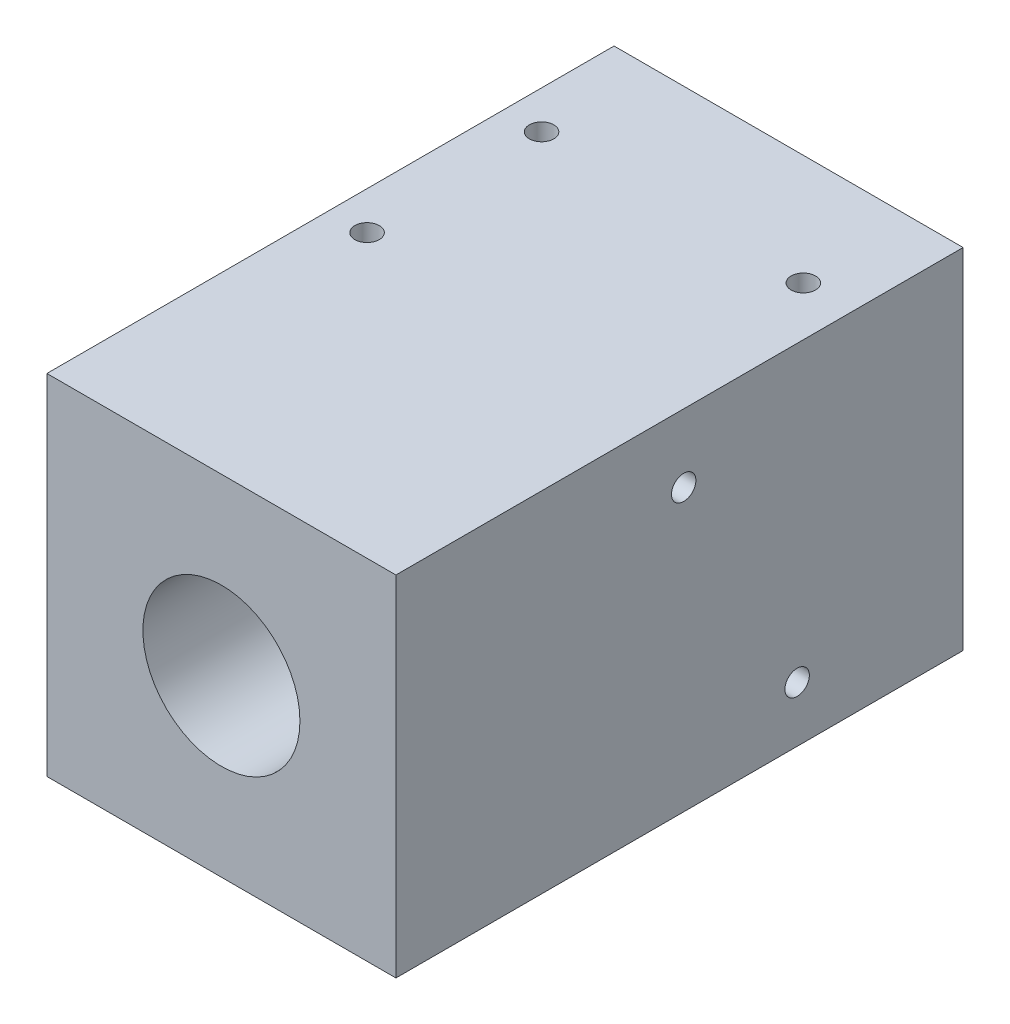
ISO-10303-21;
HEADER;
FILE_DESCRIPTION(('STEP AP214'),'2;1');
FILE_NAME('part.step','',(''),(''),'','','');
FILE_SCHEMA(('AUTOMOTIVE_DESIGN { 1 0 10303 214 1 1 1 1 }'));
ENDSEC;
DATA;
#1=APPLICATION_CONTEXT('core data for automotive mechanical design processes');
#2=APPLICATION_PROTOCOL_DEFINITION('international standard','automotive_design',2000,#1);
#3=PRODUCT_CONTEXT('',#1,'mechanical');
#4=PRODUCT('Part','Part','',(#3));
#5=PRODUCT_RELATED_PRODUCT_CATEGORY('part','',(#4));
#6=PRODUCT_DEFINITION_FORMATION('','',#4);
#7=PRODUCT_DEFINITION_CONTEXT('part definition',#1,'design');
#8=PRODUCT_DEFINITION('design','',#6,#7);
#9=PRODUCT_DEFINITION_SHAPE('','',#8);
#10=(LENGTH_UNIT() NAMED_UNIT(*) SI_UNIT(.MILLI.,.METRE.));
#11=(NAMED_UNIT(*) PLANE_ANGLE_UNIT() SI_UNIT($,.RADIAN.));
#12=(NAMED_UNIT(*) SI_UNIT($,.STERADIAN.) SOLID_ANGLE_UNIT());
#13=UNCERTAINTY_MEASURE_WITH_UNIT(LENGTH_MEASURE(1.E-05),#10,'distance_accuracy_value','');
#14=(GEOMETRIC_REPRESENTATION_CONTEXT(3) GLOBAL_UNCERTAINTY_ASSIGNED_CONTEXT((#13)) GLOBAL_UNIT_ASSIGNED_CONTEXT((#10,
#11,#12)) REPRESENTATION_CONTEXT('',''));
#15=CARTESIAN_POINT('',(0.,0.,0.));
#16=DIRECTION('',(0.,0.,1.));
#17=DIRECTION('',(1.,0.,0.));
#18=AXIS2_PLACEMENT_3D('',#15,#16,#17);
#19=CARTESIAN_POINT('',(0.,0.,65.));
#20=DIRECTION('',(0.,0.,-1.));
#21=DIRECTION('',(-1.,0.,0.));
#22=AXIS2_PLACEMENT_3D('',#19,#20,#21);
#23=PLANE('',#22);
#24=DIRECTION('',(0.,1.,0.));
#25=VECTOR('',#24,1.);
#26=CARTESIAN_POINT('',(20.,-20.,65.));
#27=LINE('',#26,#25);
#28=CARTESIAN_POINT('',(20.,-20.,65.));
#29=VERTEX_POINT('',#28);
#30=CARTESIAN_POINT('',(20.,20.,65.));
#31=VERTEX_POINT('',#30);
#32=EDGE_CURVE('E87',#29,#31,#27,.T.);
#33=ORIENTED_EDGE('',*,*,#32,.T.);
#34=DIRECTION('',(-1.,0.,0.));
#35=VECTOR('',#34,1.);
#36=CARTESIAN_POINT('',(-20.,20.,65.));
#37=LINE('',#36,#35);
#38=CARTESIAN_POINT('',(-20.,20.,65.));
#39=VERTEX_POINT('',#38);
#40=EDGE_CURVE('E82',#31,#39,#37,.T.);
#41=ORIENTED_EDGE('',*,*,#40,.T.);
#42=DIRECTION('',(0.,-1.,0.));
#43=VECTOR('',#42,1.);
#44=CARTESIAN_POINT('',(-20.,-20.,65.));
#45=LINE('',#44,#43);
#46=CARTESIAN_POINT('',(-20.,-20.,65.));
#47=VERTEX_POINT('',#46);
#48=EDGE_CURVE('E85',#39,#47,#45,.T.);
#49=ORIENTED_EDGE('',*,*,#48,.T.);
#50=DIRECTION('',(1.,0.,0.));
#51=VECTOR('',#50,1.);
#52=CARTESIAN_POINT('',(-20.,-20.,65.));
#53=LINE('',#52,#51);
#54=EDGE_CURVE('E52',#47,#29,#53,.T.);
#55=ORIENTED_EDGE('',*,*,#54,.T.);
#56=EDGE_LOOP('',(#33,#41,#49,#55));
#57=FACE_BOUND('',#56,.T.);
#58=CARTESIAN_POINT('',(0.,0.,65.));
#59=DIRECTION('',(0.,0.,1.));
#60=DIRECTION('',(1.,0.,0.));
#61=AXIS2_PLACEMENT_3D('',#58,#59,#60);
#62=CIRCLE('',#61,9.);
#63=CARTESIAN_POINT('',(9.,0.,65.));
#64=VERTEX_POINT('',#63);
#65=EDGE_CURVE('E103',#64,#64,#62,.T.);
#66=ORIENTED_EDGE('',*,*,#65,.F.);
#67=EDGE_LOOP('',(#66));
#68=FACE_BOUND('',#67,.T.);
#69=ADVANCED_FACE('F33',(#57,#68),#23,.F.);
#70=CARTESIAN_POINT('',(0.,0.,0.));
#71=DIRECTION('',(0.,0.,-1.));
#72=DIRECTION('',(-1.,0.,0.));
#73=AXIS2_PLACEMENT_3D('',#70,#71,#72);
#74=PLANE('',#73);
#75=DIRECTION('',(0.,1.,0.));
#76=VECTOR('',#75,1.);
#77=CARTESIAN_POINT('',(20.,-20.,0.));
#78=LINE('',#77,#76);
#79=CARTESIAN_POINT('',(20.,-20.,0.));
#80=VERTEX_POINT('',#79);
#81=CARTESIAN_POINT('',(20.,20.,0.));
#82=VERTEX_POINT('',#81);
#83=EDGE_CURVE('E100',#80,#82,#78,.T.);
#84=ORIENTED_EDGE('',*,*,#83,.F.);
#85=DIRECTION('',(1.,0.,0.));
#86=VECTOR('',#85,1.);
#87=CARTESIAN_POINT('',(-20.,-20.,0.));
#88=LINE('',#87,#86);
#89=CARTESIAN_POINT('',(-20.,-20.,0.));
#90=VERTEX_POINT('',#89);
#91=EDGE_CURVE('E75',#90,#80,#88,.T.);
#92=ORIENTED_EDGE('',*,*,#91,.F.);
#93=DIRECTION('',(0.,-1.,0.));
#94=VECTOR('',#93,1.);
#95=CARTESIAN_POINT('',(-20.,-20.,0.));
#96=LINE('',#95,#94);
#97=CARTESIAN_POINT('',(-20.,20.,0.));
#98=VERTEX_POINT('',#97);
#99=EDGE_CURVE('E69',#98,#90,#96,.T.);
#100=ORIENTED_EDGE('',*,*,#99,.F.);
#101=DIRECTION('',(-1.,0.,0.));
#102=VECTOR('',#101,1.);
#103=CARTESIAN_POINT('',(-20.,20.,0.));
#104=LINE('',#103,#102);
#105=EDGE_CURVE('E91',#82,#98,#104,.T.);
#106=ORIENTED_EDGE('',*,*,#105,.F.);
#107=EDGE_LOOP('',(#84,#92,#100,#106));
#108=FACE_BOUND('',#107,.T.);
#109=CARTESIAN_POINT('',(0.,0.,0.));
#110=DIRECTION('',(0.,0.,1.));
#111=DIRECTION('',(1.,0.,0.));
#112=AXIS2_PLACEMENT_3D('',#109,#110,#111);
#113=CIRCLE('',#112,9.);
#114=CARTESIAN_POINT('',(9.,0.,0.));
#115=VERTEX_POINT('',#114);
#116=EDGE_CURVE('E172',#115,#115,#113,.T.);
#117=ORIENTED_EDGE('',*,*,#116,.T.);
#118=EDGE_LOOP('',(#117));
#119=FACE_BOUND('',#118,.T.);
#120=ADVANCED_FACE('F134',(#108,#119),#74,.T.);
#121=CARTESIAN_POINT('',(20.,-20.,65.));
#122=DIRECTION('',(-1.,0.,0.));
#123=DIRECTION('',(0.,0.,1.));
#124=AXIS2_PLACEMENT_3D('',#121,#122,#123);
#125=PLANE('',#124);
#126=CARTESIAN_POINT('',(20.,12.2053062360702,32.0211991640393));
#127=DIRECTION('',(1.,0.,0.));
#128=DIRECTION('',(0.,0.,-1.));
#129=AXIS2_PLACEMENT_3D('',#126,#127,#128);
#130=CIRCLE('',#129,1.4);
#131=CARTESIAN_POINT('',(20.,12.2053062360702,30.6211991640393));
#132=VERTEX_POINT('',#131);
#133=EDGE_CURVE('E116',#132,#132,#130,.T.);
#134=ORIENTED_EDGE('',*,*,#133,.F.);
#135=EDGE_LOOP('',(#134));
#136=FACE_BOUND('',#135,.T.);
#137=CARTESIAN_POINT('',(20.,-13.6412808856617,19.0212010713877));
#138=DIRECTION('',(1.,0.,0.));
#139=DIRECTION('',(0.,0.,-1.));
#140=AXIS2_PLACEMENT_3D('',#137,#138,#139);
#141=CIRCLE('',#140,1.39999999999998);
#142=CARTESIAN_POINT('',(20.,-13.6412808856617,17.6212010713877));
#143=VERTEX_POINT('',#142);
#144=EDGE_CURVE('E211',#143,#143,#141,.T.);
#145=ORIENTED_EDGE('',*,*,#144,.F.);
#146=EDGE_LOOP('',(#145));
#147=FACE_BOUND('',#146,.T.);
#148=ORIENTED_EDGE('',*,*,#83,.T.);
#149=DIRECTION('',(0.,0.,-1.));
#150=VECTOR('',#149,1.);
#151=CARTESIAN_POINT('',(20.,20.,65.));
#152=LINE('',#151,#150);
#153=EDGE_CURVE('E11',#31,#82,#152,.T.);
#154=ORIENTED_EDGE('',*,*,#153,.F.);
#155=ORIENTED_EDGE('',*,*,#32,.F.);
#156=DIRECTION('',(0.,0.,-1.));
#157=VECTOR('',#156,1.);
#158=CARTESIAN_POINT('',(20.,-20.,65.));
#159=LINE('',#158,#157);
#160=EDGE_CURVE('E96',#29,#80,#159,.T.);
#161=ORIENTED_EDGE('',*,*,#160,.T.);
#162=EDGE_LOOP('',(#148,#154,#155,#161));
#163=FACE_BOUND('',#162,.T.);
#164=ADVANCED_FACE('F35',(#136,#147,#163),#125,.F.);
#165=CARTESIAN_POINT('',(-20.,20.,65.));
#166=DIRECTION('',(0.,-1.,0.));
#167=DIRECTION('',(0.,0.,-1.));
#168=AXIS2_PLACEMENT_3D('',#165,#166,#167);
#169=PLANE('',#168);
#170=CARTESIAN_POINT('',(14.3647560439748,20.,12.6729449011598));
#171=DIRECTION('',(0.,1.,0.));
#172=DIRECTION('',(0.,0.,1.));
#173=AXIS2_PLACEMENT_3D('',#170,#171,#172);
#174=CIRCLE('',#173,1.4);
#175=CARTESIAN_POINT('',(14.3647560439748,20.,14.0729449011598));
#176=VERTEX_POINT('',#175);
#177=EDGE_CURVE('E160',#176,#176,#174,.T.);
#178=ORIENTED_EDGE('',*,*,#177,.F.);
#179=EDGE_LOOP('',(#178));
#180=FACE_BOUND('',#179,.T.);
#181=CARTESIAN_POINT('',(-15.6352439560252,20.,32.6729449011597));
#182=DIRECTION('',(0.,1.,0.));
#183=DIRECTION('',(0.,0.,1.));
#184=AXIS2_PLACEMENT_3D('',#181,#182,#183);
#185=CIRCLE('',#184,1.4);
#186=CARTESIAN_POINT('',(-15.6352439560252,20.,34.0729449011597));
#187=VERTEX_POINT('',#186);
#188=EDGE_CURVE('E164',#187,#187,#185,.T.);
#189=ORIENTED_EDGE('',*,*,#188,.F.);
#190=EDGE_LOOP('',(#189));
#191=FACE_BOUND('',#190,.T.);
#192=CARTESIAN_POINT('',(-15.6352439560252,20.,12.6729449011598));
#193=DIRECTION('',(0.,1.,0.));
#194=DIRECTION('',(0.,0.,1.));
#195=AXIS2_PLACEMENT_3D('',#192,#193,#194);
#196=CIRCLE('',#195,1.4);
#197=CARTESIAN_POINT('',(-15.6352439560252,20.,14.0729449011598));
#198=VERTEX_POINT('',#197);
#199=EDGE_CURVE('E167',#198,#198,#196,.T.);
#200=ORIENTED_EDGE('',*,*,#199,.F.);
#201=EDGE_LOOP('',(#200));
#202=FACE_BOUND('',#201,.T.);
#203=ORIENTED_EDGE('',*,*,#105,.T.);
#204=DIRECTION('',(0.,0.,-1.));
#205=VECTOR('',#204,1.);
#206=CARTESIAN_POINT('',(-20.,20.,65.));
#207=LINE('',#206,#205);
#208=EDGE_CURVE('E43',#39,#98,#207,.T.);
#209=ORIENTED_EDGE('',*,*,#208,.F.);
#210=ORIENTED_EDGE('',*,*,#40,.F.);
#211=ORIENTED_EDGE('',*,*,#153,.T.);
#212=EDGE_LOOP('',(#203,#209,#210,#211));
#213=FACE_BOUND('',#212,.T.);
#214=ADVANCED_FACE('F90',(#180,#191,#202,#213),#169,.F.);
#215=CARTESIAN_POINT('',(-20.,-20.,65.));
#216=DIRECTION('',(1.,0.,0.));
#217=DIRECTION('',(0.,0.,-1.));
#218=AXIS2_PLACEMENT_3D('',#215,#216,#217);
#219=PLANE('',#218);
#220=CARTESIAN_POINT('',(-20.,12.2053062360702,32.0211991640393));
#221=DIRECTION('',(1.,0.,0.));
#222=DIRECTION('',(0.,0.,-1.));
#223=AXIS2_PLACEMENT_3D('',#220,#221,#222);
#224=CIRCLE('',#223,1.4);
#225=CARTESIAN_POINT('',(-20.,12.2053062360702,30.6211991640393));
#226=VERTEX_POINT('',#225);
#227=EDGE_CURVE('E115',#226,#226,#224,.T.);
#228=ORIENTED_EDGE('',*,*,#227,.T.);
#229=EDGE_LOOP('',(#228));
#230=FACE_BOUND('',#229,.T.);
#231=CARTESIAN_POINT('',(-20.,-13.6412808856617,19.0212010713877));
#232=DIRECTION('',(1.,0.,0.));
#233=DIRECTION('',(0.,0.,-1.));
#234=AXIS2_PLACEMENT_3D('',#231,#232,#233);
#235=CIRCLE('',#234,1.39999999999998);
#236=CARTESIAN_POINT('',(-20.,-13.6412808856617,17.6212010713877));
#237=VERTEX_POINT('',#236);
#238=EDGE_CURVE('E37',#237,#237,#235,.T.);
#239=ORIENTED_EDGE('',*,*,#238,.T.);
#240=EDGE_LOOP('',(#239));
#241=FACE_BOUND('',#240,.T.);
#242=ORIENTED_EDGE('',*,*,#99,.T.);
#243=DIRECTION('',(0.,0.,-1.));
#244=VECTOR('',#243,1.);
#245=CARTESIAN_POINT('',(-20.,-20.,65.));
#246=LINE('',#245,#244);
#247=EDGE_CURVE('E92',#47,#90,#246,.T.);
#248=ORIENTED_EDGE('',*,*,#247,.F.);
#249=ORIENTED_EDGE('',*,*,#48,.F.);
#250=ORIENTED_EDGE('',*,*,#208,.T.);
#251=EDGE_LOOP('',(#242,#248,#249,#250));
#252=FACE_BOUND('',#251,.T.);
#253=ADVANCED_FACE('F94',(#230,#241,#252),#219,.F.);
#254=CARTESIAN_POINT('',(-20.,-20.,65.));
#255=DIRECTION('',(0.,1.,0.));
#256=DIRECTION('',(0.,0.,1.));
#257=AXIS2_PLACEMENT_3D('',#254,#255,#256);
#258=PLANE('',#257);
#259=CARTESIAN_POINT('',(14.3647560439748,-20.,12.6729449011598));
#260=DIRECTION('',(0.,1.,0.));
#261=DIRECTION('',(0.,0.,1.));
#262=AXIS2_PLACEMENT_3D('',#259,#260,#261);
#263=CIRCLE('',#262,1.4);
#264=CARTESIAN_POINT('',(14.3647560439748,-20.,14.0729449011598));
#265=VERTEX_POINT('',#264);
#266=EDGE_CURVE('E204',#265,#265,#263,.T.);
#267=ORIENTED_EDGE('',*,*,#266,.T.);
#268=EDGE_LOOP('',(#267));
#269=FACE_BOUND('',#268,.T.);
#270=CARTESIAN_POINT('',(-15.6352439560252,-20.,32.6729449011597));
#271=DIRECTION('',(0.,1.,0.));
#272=DIRECTION('',(0.,0.,1.));
#273=AXIS2_PLACEMENT_3D('',#270,#271,#272);
#274=CIRCLE('',#273,1.4);
#275=CARTESIAN_POINT('',(-15.6352439560252,-20.,34.0729449011597));
#276=VERTEX_POINT('',#275);
#277=EDGE_CURVE('E174',#276,#276,#274,.T.);
#278=ORIENTED_EDGE('',*,*,#277,.T.);
#279=EDGE_LOOP('',(#278));
#280=FACE_BOUND('',#279,.T.);
#281=CARTESIAN_POINT('',(-15.6352439560252,-20.,12.6729449011598));
#282=DIRECTION('',(0.,1.,0.));
#283=DIRECTION('',(0.,0.,1.));
#284=AXIS2_PLACEMENT_3D('',#281,#282,#283);
#285=CIRCLE('',#284,1.4);
#286=CARTESIAN_POINT('',(-15.6352439560252,-20.,14.0729449011598));
#287=VERTEX_POINT('',#286);
#288=EDGE_CURVE('E169',#287,#287,#285,.T.);
#289=ORIENTED_EDGE('',*,*,#288,.T.);
#290=EDGE_LOOP('',(#289));
#291=FACE_BOUND('',#290,.T.);
#292=ORIENTED_EDGE('',*,*,#91,.T.);
#293=ORIENTED_EDGE('',*,*,#160,.F.);
#294=ORIENTED_EDGE('',*,*,#54,.F.);
#295=ORIENTED_EDGE('',*,*,#247,.T.);
#296=EDGE_LOOP('',(#292,#293,#294,#295));
#297=FACE_BOUND('',#296,.T.);
#298=ADVANCED_FACE('F145',(#269,#280,#291,#297),#258,.F.);
#299=CARTESIAN_POINT('',(0.,0.,65.));
#300=DIRECTION('',(0.,0.,-1.));
#301=DIRECTION('',(-1.,0.,0.));
#302=AXIS2_PLACEMENT_3D('',#299,#300,#301);
#303=CYLINDRICAL_SURFACE('',#302,9.);
#304=ORIENTED_EDGE('',*,*,#65,.T.);
#305=EDGE_LOOP('',(#304));
#306=FACE_BOUND('',#305,.T.);
#307=ORIENTED_EDGE('',*,*,#116,.F.);
#308=EDGE_LOOP('',(#307));
#309=FACE_BOUND('',#308,.T.);
#310=ADVANCED_FACE('F142',(#306,#309),#303,.F.);
#311=CARTESIAN_POINT('',(-15.6352439560252,-20.,12.6729449011598));
#312=DIRECTION('',(0.,1.,0.));
#313=DIRECTION('',(0.,0.,1.));
#314=AXIS2_PLACEMENT_3D('',#311,#312,#313);
#315=CYLINDRICAL_SURFACE('',#314,1.4);
#316=ORIENTED_EDGE('',*,*,#288,.F.);
#317=EDGE_LOOP('',(#316));
#318=FACE_BOUND('',#317,.T.);
#319=ORIENTED_EDGE('',*,*,#199,.T.);
#320=EDGE_LOOP('',(#319));
#321=FACE_BOUND('',#320,.T.);
#322=ADVANCED_FACE('F185',(#318,#321),#315,.F.);
#323=CARTESIAN_POINT('',(-15.6352439560252,-20.,32.6729449011597));
#324=DIRECTION('',(0.,1.,0.));
#325=DIRECTION('',(0.,0.,1.));
#326=AXIS2_PLACEMENT_3D('',#323,#324,#325);
#327=CYLINDRICAL_SURFACE('',#326,1.4);
#328=CARTESIAN_POINT('',(-15.6352439560252,11.0220414482554,31.2729449011597));
#329=CARTESIAN_POINT('',(-15.7089727207362,11.0220292491392,31.2729512518251));
#330=CARTESIAN_POINT('',(-15.7827887616801,11.0182676718205,31.2788125417637));
#331=CARTESIAN_POINT('',(-15.9280301859704,11.0041392721552,31.3019174638837));
#332=CARTESIAN_POINT('',(-15.9994496739583,10.9937572623004,31.3191872708929));
#333=CARTESIAN_POINT('',(-16.1375128844753,10.9688080653261,31.3641432521788));
#334=CARTESIAN_POINT('',(-16.2041873282419,10.9542715937821,31.3917534248516));
#335=CARTESIAN_POINT('',(-16.3322705456156,10.9236678537403,31.4566736525267));
#336=CARTESIAN_POINT('',(-16.3936758907424,10.9075996026871,31.4939899603848));
#337=CARTESIAN_POINT('',(-16.5163533936299,10.8750320029861,31.5821069406718));
#338=CARTESIAN_POINT('',(-16.576948298674,10.8586614431955,31.6339060370579));
#339=CARTESIAN_POINT('',(-16.688978680077,10.8310289912443,31.7477477773131));
#340=CARTESIAN_POINT('',(-16.7404290768942,10.8197587299383,31.8097734104209));
#341=CARTESIAN_POINT('',(-16.8209800270427,10.8076317010662,31.9261260263481));
#342=CARTESIAN_POINT('',(-16.8524666640476,10.8048978925131,31.9786057076898));
#343=CARTESIAN_POINT('',(-16.908276169548,10.8058123689881,32.087194080726));
#344=CARTESIAN_POINT('',(-16.9326055875218,10.8094547978513,32.1432993969342));
#345=CARTESIAN_POINT('',(-16.9735939054543,10.8242018395698,32.2575906615959));
#346=CARTESIAN_POINT('',(-16.9902210922503,10.8353368492636,32.3157841676451));
#347=CARTESIAN_POINT('',(-17.0156037090995,10.8655397121785,32.4318313595907));
#348=CARTESIAN_POINT('',(-17.0243585798987,10.8846081288528,32.4896850210543));
#349=CARTESIAN_POINT('',(-17.0343266322935,10.9289796132987,32.5993633490373));
#350=CARTESIAN_POINT('',(-17.0359763411876,10.9538193706227,32.6513389537499));
#351=CARTESIAN_POINT('',(-17.0339274594001,11.0096424744936,32.7517407515436));
#352=CARTESIAN_POINT('',(-17.0302275105229,11.0406273794751,32.8001660399744));
#353=CARTESIAN_POINT('',(-17.0181739401447,11.1110869346736,32.8967432829112));
#354=CARTESIAN_POINT('',(-17.0094261050692,11.1510785425142,32.9444662229626));
#355=CARTESIAN_POINT('',(-16.9887053136798,11.2366081119936,33.0338482049451));
#356=CARTESIAN_POINT('',(-16.9767301590811,11.282149842466,33.0755030837196));
#357=CARTESIAN_POINT('',(-16.9488230013888,11.3871372745818,33.1595925450437));
#358=CARTESIAN_POINT('',(-16.9325712601562,11.4475820533161,33.2006776572825));
#359=CARTESIAN_POINT('',(-16.9007181929208,11.5742997223601,33.2730633173601));
#360=CARTESIAN_POINT('',(-16.8851175340487,11.6405783842123,33.3043540328486));
#361=CARTESIAN_POINT('',(-16.856063422713,11.7847956266108,33.3589901062887));
#362=CARTESIAN_POINT('',(-16.8429793579716,11.8632378142437,33.3812316340424));
#363=CARTESIAN_POINT('',(-16.824579246073,12.023604776296,33.4117421321114));
#364=CARTESIAN_POINT('',(-16.8192463714222,12.1055216080081,33.4200413766381));
#365=CARTESIAN_POINT('',(-16.8180024070115,12.258637081865,33.4219923292704));
#366=CARTESIAN_POINT('',(-16.8209305650264,12.3298094605987,33.4174484445403));
#367=CARTESIAN_POINT('',(-16.8330699379926,12.4701355574711,33.3977499441331));
#368=CARTESIAN_POINT('',(-16.8422859105198,12.5392877056892,33.3825872937039));
#369=CARTESIAN_POINT('',(-16.8646991413824,12.6717381262617,33.3429701168519));
#370=CARTESIAN_POINT('',(-16.8777641664106,12.7351513987166,33.3188181130201));
#371=CARTESIAN_POINT('',(-16.905764861461,12.8575337100623,33.2618284865357));
#372=CARTESIAN_POINT('',(-16.9207020692212,12.9164990310621,33.2289836990297));
#373=CARTESIAN_POINT('',(-16.9525923242794,13.0383471404138,33.1491077412753));
#374=CARTESIAN_POINT('',(-16.9694790690429,13.1003124682679,33.1006392852633));
#375=CARTESIAN_POINT('',(-16.9992024901507,13.2157409533513,32.9934156488194));
#376=CARTESIAN_POINT('',(-17.0120436128266,13.2692134123593,32.9346718727072));
#377=CARTESIAN_POINT('',(-17.0281670503666,13.3552630525591,32.8221099188646));
#378=CARTESIAN_POINT('',(-17.0329292691993,13.3898501444937,32.7700431733979));
#379=CARTESIAN_POINT('',(-17.0362452608293,13.4518125956798,32.6615976148939));
#380=CARTESIAN_POINT('',(-17.0348050449519,13.4791949104084,32.6052230290053));
#381=CARTESIAN_POINT('',(-17.0244016356284,13.5261155124408,32.4895738095465));
#382=CARTESIAN_POINT('',(-17.0153989403961,13.5456118142157,32.430285490457));
#383=CARTESIAN_POINT('',(-16.9891191891023,13.5762763548432,32.3113868190305));
#384=CARTESIAN_POINT('',(-16.9718431604182,13.5874456273007,32.2517765075866));
#385=CARTESIAN_POINT('',(-16.9309029860187,13.6013480609719,32.1395230396602));
#386=CARTESIAN_POINT('',(-16.9078939874969,13.6047086737487,32.0867141593159));
#387=CARTESIAN_POINT('',(-16.8555255894789,13.6057575039903,31.9843063496163));
#388=CARTESIAN_POINT('',(-16.826164630499,13.6034443270263,31.9347082124297));
#389=CARTESIAN_POINT('',(-16.7596052947311,13.5940105353379,31.8365435639835));
#390=CARTESIAN_POINT('',(-16.7220077317578,13.5865713567916,31.7882806348168));
#391=CARTESIAN_POINT('',(-16.6412614879932,13.5681436748089,31.6974300351092));
#392=CARTESIAN_POINT('',(-16.5981098919794,13.5571533027995,31.6548453690677));
#393=CARTESIAN_POINT('',(-16.4985915644715,13.5310063663258,31.5685299853998));
#394=CARTESIAN_POINT('',(-16.4412551088308,13.5154552719673,31.526035134851));
#395=CARTESIAN_POINT('',(-16.3207740581154,13.4842260285693,31.4501912515229));
#396=CARTESIAN_POINT('',(-16.2576220893167,13.4685477418669,31.4168540493648));
#397=CARTESIAN_POINT('',(-16.1180091617092,13.4378911456994,31.3563444643972));
#398=CARTESIAN_POINT('',(-16.0408797364785,13.423259968384,31.3305094393297));
#399=CARTESIAN_POINT('',(-15.8824211328633,13.4009517443046,31.292544458005));
#400=CARTESIAN_POINT('',(-15.8011013112053,13.3932598583162,31.2803852431017));
#401=CARTESIAN_POINT('',(-15.6464882739001,13.3874090854268,31.2710959403898));
#402=CARTESIAN_POINT('',(-15.5733236410299,13.3882732882887,31.2724261325007));
#403=CARTESIAN_POINT('',(-15.4284955298766,13.3969894566548,31.286383277733));
#404=CARTESIAN_POINT('',(-15.3568328738817,13.4048451525306,31.2990162615757));
#405=CARTESIAN_POINT('',(-15.2217761860715,13.4250217777541,31.3336972568301));
#406=CARTESIAN_POINT('',(-15.1581498705794,13.4370081876047,31.3550575815542));
#407=CARTESIAN_POINT('',(-15.0349910936376,13.463418358067,31.4063934888064));
#408=CARTESIAN_POINT('',(-14.9754618491173,13.4778440038745,31.4363757475645));
#409=CARTESIAN_POINT('',(-14.8522964186685,13.5092629127094,31.5097971626124));
#410=CARTESIAN_POINT('',(-14.7894875490653,13.5263030715724,31.5546113361599));
#411=CARTESIAN_POINT('',(-14.6716631133658,13.5574062858985,31.6543884983483));
#412=CARTESIAN_POINT('',(-14.6166420352132,13.5714714505293,31.7093442448569));
#413=CARTESIAN_POINT('',(-14.5252249399103,13.5912777174622,31.8174308146905));
#414=CARTESIAN_POINT('',(-14.4872644049671,13.5980736704528,31.8690402655278));
#415=CARTESIAN_POINT('',(-14.418618933438,13.6056663891187,31.977301195377));
#416=CARTESIAN_POINT('',(-14.3879272613754,13.6064687298242,32.0339479392377));
#417=CARTESIAN_POINT('',(-14.3345690517201,13.6005117255037,32.1510202779586));
#418=CARTESIAN_POINT('',(-14.3119552272756,13.5937038672353,32.2114677717255));
#419=CARTESIAN_POINT('',(-14.2755496106071,13.5714508250422,32.3334215145621));
#420=CARTESIAN_POINT('',(-14.2617544942501,13.5560088997713,32.3949273557088));
#421=CARTESIAN_POINT('',(-14.2436654353766,13.5184480595229,32.5100110167955));
#422=CARTESIAN_POINT('',(-14.2385287743905,13.497196256055,32.5637452891862));
#423=CARTESIAN_POINT('',(-14.2342725323636,13.4481008214738,32.6683479375555));
#424=CARTESIAN_POINT('',(-14.2351543331107,13.4202556780021,32.7192156526937));
#425=CARTESIAN_POINT('',(-14.2419481962175,13.3573019801373,32.8190360531883));
#426=CARTESIAN_POINT('',(-14.2480822670863,13.3219254331662,32.8678029085309));
#427=CARTESIAN_POINT('',(-14.2641924840011,13.2455960972333,32.960020668303));
#428=CARTESIAN_POINT('',(-14.2741701948951,13.2046410415078,33.003469398076));
#429=CARTESIAN_POINT('',(-14.2984224316786,13.1102434235963,33.091697246281));
#430=CARTESIAN_POINT('',(-14.3131443911845,13.0558723398308,33.1353599264735));
#431=CARTESIAN_POINT('',(-14.3433794009837,12.9413648774603,33.2141192285161));
#432=CARTESIAN_POINT('',(-14.3588935385152,12.8812204698814,33.2492036730261));
#433=CARTESIAN_POINT('',(-14.3904481406123,12.7465684531093,33.3148191885033));
#434=CARTESIAN_POINT('',(-14.4062158161936,12.6712620124371,33.3438681094809));
#435=CARTESIAN_POINT('',(-14.431756211514,12.515885496371,33.3886962779139));
#436=CARTESIAN_POINT('',(-14.441540136279,12.4358246344737,33.4045003480416));
#437=CARTESIAN_POINT('',(-14.4519185254107,12.2805342439282,33.4211638298534));
#438=CARTESIAN_POINT('',(-14.4532302170087,12.2054805126741,33.4231904478857));
#439=CARTESIAN_POINT('',(-14.4482286419548,12.0562700639773,33.4152479615648));
#440=CARTESIAN_POINT('',(-14.4419140563868,11.9821135039352,33.4052767822699));
#441=CARTESIAN_POINT('',(-14.424173466179,11.8442031147154,33.3754874657997));
#442=CARTESIAN_POINT('',(-14.4133058037039,11.7801399385905,33.3567241040326));
#443=CARTESIAN_POINT('',(-14.3885941986453,11.6557967485266,33.310556529804));
#444=CARTESIAN_POINT('',(-14.3747479535117,11.595519708244,33.2831456247934));
#445=CARTESIAN_POINT('',(-14.3441328830923,11.471248368413,33.2157079887742));
#446=CARTESIAN_POINT('',(-14.3272297682596,11.4079615636861,33.1744354502803));
#447=CARTESIAN_POINT('',(-14.2954324775777,11.288527258144,33.0819592908828));
#448=CARTESIAN_POINT('',(-14.2805375127501,11.2323769539822,33.0307595896335));
#449=CARTESIAN_POINT('',(-14.2576603666972,11.1360173756551,32.9272233495273));
#450=CARTESIAN_POINT('',(-14.2489942766485,11.0946767503513,32.8760961702403));
#451=CARTESIAN_POINT('',(-14.2374272203572,11.0193489702754,32.7680790800949));
#452=CARTESIAN_POINT('',(-14.2345214051941,10.9853556521387,32.711194058548));
#453=CARTESIAN_POINT('',(-14.2362802952648,10.9255697395027,32.5927765650687));
#454=CARTESIAN_POINT('',(-14.2410015671165,10.8998401327818,32.5312126244159));
#455=CARTESIAN_POINT('',(-14.2594314594731,10.8576943030276,32.4062705838883));
#456=CARTESIAN_POINT('',(-14.2731341658898,10.8412719646112,32.3428937040414));
#457=CARTESIAN_POINT('',(-14.3076078716245,10.819077046292,32.2249665115766));
#458=CARTESIAN_POINT('',(-14.3272965914673,10.8122394792158,32.1702929854154));
#459=CARTESIAN_POINT('',(-14.3735200741087,10.8049211298837,32.0634863524057));
#460=CARTESIAN_POINT('',(-14.4000562636636,10.8044416735118,32.0113537776909));
#461=CARTESIAN_POINT('',(-14.4599393251643,10.8087916009764,31.9099208157136));
#462=CARTESIAN_POINT('',(-14.4934205356651,10.8137355112535,31.8607055756605));
#463=CARTESIAN_POINT('',(-14.5659988853596,10.8277134390608,31.7672854721368));
#464=CARTESIAN_POINT('',(-14.6050976629496,10.8367486515031,31.7230820771529));
#465=CARTESIAN_POINT('',(-14.6951035934817,10.8591892488216,31.6333187114469));
#466=CARTESIAN_POINT('',(-14.7468924563714,10.8730723206045,31.5887635070283));
#467=CARTESIAN_POINT('',(-14.8562032676185,10.9021548228317,31.5077256382402));
#468=CARTESIAN_POINT('',(-14.9137345336043,10.9173563872503,31.471256413434));
#469=CARTESIAN_POINT('',(-15.0437339479515,10.9492230328911,31.4015563629446));
#470=CARTESIAN_POINT('',(-15.1170916712206,10.9657082316678,31.3698848620768));
#471=CARTESIAN_POINT('',(-15.268907565567,10.9935744973921,31.3193754942589));
#472=CARTESIAN_POINT('',(-15.3473494803298,11.0049709944049,31.3004987393919));
#473=CARTESIAN_POINT('',(-15.4614582469273,11.01552094437,31.2833366743439));
#474=CARTESIAN_POINT('',(-15.4960498556761,11.0179506682774,31.279446732987));
#475=CARTESIAN_POINT('',(-15.5655024475423,11.0212138183314,31.2742493240171));
#476=CARTESIAN_POINT('',(-15.6003634348552,11.022047219565,31.272941896708));
#477=CARTESIAN_POINT('',(-15.6352439560252,11.0220414482554,31.2729449011597));
#478=B_SPLINE_CURVE_WITH_KNOTS('',3,(#328,#329,#330,#331,#332,#333,#334,#335,#336,#337,#338,
#339,#340,#341,#342,#343,#344,#345,#346,#347,#348,#349,#350,#351,#352,#353,#354,#355,#356,#357,
#358,#359,#360,#361,#362,#363,#364,#365,#366,#367,#368,#369,#370,#371,#372,#373,#374,#375,#376,
#377,#378,#379,#380,#381,#382,#383,#384,#385,#386,#387,#388,#389,#390,#391,#392,#393,#394,#395,
#396,#397,#398,#399,#400,#401,#402,#403,#404,#405,#406,#407,#408,#409,#410,#411,#412,#413,#414,
#415,#416,#417,#418,#419,#420,#421,#422,#423,#424,#425,#426,#427,#428,#429,#430,#431,#432,#433,
#434,#435,#436,#437,#438,#439,#440,#441,#442,#443,#444,#445,#446,#447,#448,#449,#450,#451,#452,
#453,#454,#455,#456,#457,#458,#459,#460,#461,#462,#463,#464,#465,#466,#467,#468,#469,#470,#471,
#472,#473,#474,#475,#476,#477),.UNSPECIFIED.,.T.,.F.,(4,2,2,2,2,2,2,2,2,2,2,2,2,2,2,2,2,2,2,2,2,
2,2,2,2,2,2,2,2,2,2,2,2,2,2,2,2,2,2,2,2,2,2,2,2,2,2,2,2,2,2,2,2,2,2,2,2,2,2,2,2,2,2,2,2,2,2,2,2,
2,2,2,2,2,4),(0.,0.221034785973602,0.442578466750436,0.662524779355597,0.882613137542165,
1.12557773778891,1.3681421956854,1.55116752969655,1.73402485486524,1.91762852727319,
2.10124524196434,2.27340383923727,2.44560615259364,2.63353810813651,2.8215983982702,
3.04531349037584,3.26925244950612,3.51552831292989,3.76126871953867,3.97426459852478,
4.18742181647823,4.39397317878447,4.60069532000061,4.84096904633704,5.08097777166072,
5.26827800080312,5.45539674168752,5.64349899868642,5.83157790332307,6.00392613078253,
6.17631671994949,6.36052022367595,6.54482081017476,6.76309600826021,6.98165188046286,
7.22821358551531,7.47424677589417,7.69254451398943,7.91095879660602,8.11473597223369,
8.31867136568229,8.55469121964768,8.79054317867078,8.98304228581853,9.17536231529732,
9.36891536685662,9.56239541723962,9.73564241854579,9.90892919723434,10.0899240199289,
10.2709926084399,10.4839903939035,10.6972888100126,10.9427196167162,11.1876894171326,
11.4116148009666,11.6355789168161,11.8377082694833,12.0399944404388,12.2713039350133,
12.502522284339,12.7006792069989,12.8986692529281,13.0981344537017,13.297468442557,
13.4721780440125,13.6469240778381,13.8254325532333,14.003993197754,14.2123538314841,
14.4210582240261,14.6646354926466,14.9074690806224,15.0120373348402,15.1166072209855),.UNSPECIFIED.);
#479=CARTESIAN_POINT('',(-15.6352439560252,11.0220414482554,31.2729449011597));
#480=VERTEX_POINT('',#479);
#481=EDGE_CURVE('E108',#480,#480,#478,.T.);
#482=ORIENTED_EDGE('',*,*,#481,.T.);
#483=EDGE_LOOP('',(#482));
#484=FACE_BOUND('',#483,.T.);
#485=ORIENTED_EDGE('',*,*,#277,.F.);
#486=EDGE_LOOP('',(#485));
#487=FACE_BOUND('',#486,.T.);
#488=ORIENTED_EDGE('',*,*,#188,.T.);
#489=EDGE_LOOP('',(#488));
#490=FACE_BOUND('',#489,.T.);
#491=ADVANCED_FACE('F117',(#484,#487,#490),#327,.F.);
#492=CARTESIAN_POINT('',(14.3647560439748,-20.,12.6729449011598));
#493=DIRECTION('',(0.,1.,0.));
#494=DIRECTION('',(0.,0.,1.));
#495=AXIS2_PLACEMENT_3D('',#492,#493,#494);
#496=CYLINDRICAL_SURFACE('',#495,1.4);
#497=ORIENTED_EDGE('',*,*,#266,.F.);
#498=EDGE_LOOP('',(#497));
#499=FACE_BOUND('',#498,.T.);
#500=ORIENTED_EDGE('',*,*,#177,.T.);
#501=EDGE_LOOP('',(#500));
#502=FACE_BOUND('',#501,.T.);
#503=ADVANCED_FACE('F125',(#499,#502),#496,.F.);
#504=CARTESIAN_POINT('',(-45.,12.2053062360702,32.0211991640393));
#505=DIRECTION('',(1.,0.,0.));
#506=DIRECTION('',(0.,0.,-1.));
#507=AXIS2_PLACEMENT_3D('',#504,#505,#506);
#508=CYLINDRICAL_SURFACE('',#507,1.4);
#509=ORIENTED_EDGE('',*,*,#481,.F.);
#510=EDGE_LOOP('',(#509));
#511=FACE_BOUND('',#510,.T.);
#512=ORIENTED_EDGE('',*,*,#133,.T.);
#513=EDGE_LOOP('',(#512));
#514=FACE_BOUND('',#513,.T.);
#515=ORIENTED_EDGE('',*,*,#227,.F.);
#516=EDGE_LOOP('',(#515));
#517=FACE_BOUND('',#516,.T.);
#518=ADVANCED_FACE('F121',(#511,#514,#517),#508,.F.);
#519=CARTESIAN_POINT('',(-45.,-13.6412808856617,19.0212010713877));
#520=DIRECTION('',(1.,0.,0.));
#521=DIRECTION('',(0.,0.,-1.));
#522=AXIS2_PLACEMENT_3D('',#519,#520,#521);
#523=CYLINDRICAL_SURFACE('',#522,1.39999999999998);
#524=ORIENTED_EDGE('',*,*,#144,.T.);
#525=EDGE_LOOP('',(#524));
#526=FACE_BOUND('',#525,.T.);
#527=ORIENTED_EDGE('',*,*,#238,.F.);
#528=EDGE_LOOP('',(#527));
#529=FACE_BOUND('',#528,.T.);
#530=ADVANCED_FACE('F124',(#526,#529),#523,.F.);
#531=CLOSED_SHELL('',(#69,#120,#164,#214,#253,#298,#310,#322,#491,#503,#518,#530));
#532=MANIFOLD_SOLID_BREP('B2',#531);
#533=ADVANCED_BREP_SHAPE_REPRESENTATION('',(#18,#532),#14);
#534=SHAPE_DEFINITION_REPRESENTATION(#9,#533);
ENDSEC;
END-ISO-10303-21;
